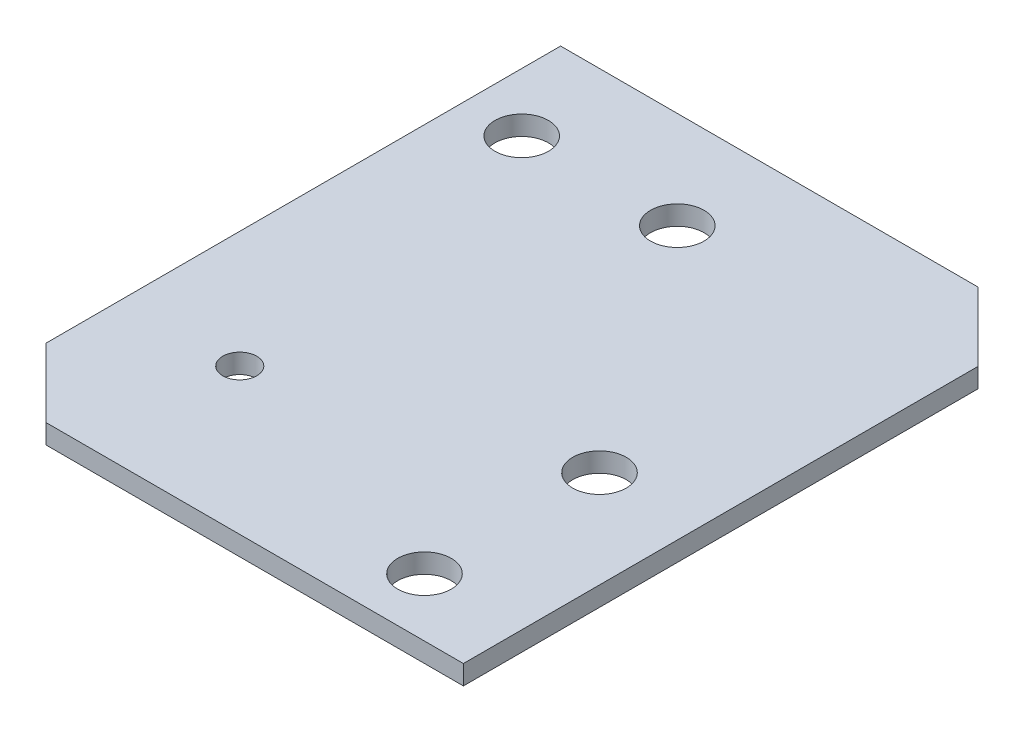
ISO-10303-21;
HEADER;
FILE_DESCRIPTION(('STEP AP214'),'2;1');
FILE_NAME('part.step','',(''),(''),'','','');
FILE_SCHEMA(('AUTOMOTIVE_DESIGN { 1 0 10303 214 1 1 1 1 }'));
ENDSEC;
DATA;
#1=APPLICATION_CONTEXT('core data for automotive mechanical design processes');
#2=APPLICATION_PROTOCOL_DEFINITION('international standard','automotive_design',2000,#1);
#3=PRODUCT_CONTEXT('',#1,'mechanical');
#4=PRODUCT('Part','Part','',(#3));
#5=PRODUCT_RELATED_PRODUCT_CATEGORY('part','',(#4));
#6=PRODUCT_DEFINITION_FORMATION('','',#4);
#7=PRODUCT_DEFINITION_CONTEXT('part definition',#1,'design');
#8=PRODUCT_DEFINITION('design','',#6,#7);
#9=PRODUCT_DEFINITION_SHAPE('','',#8);
#10=(LENGTH_UNIT() NAMED_UNIT(*) SI_UNIT(.MILLI.,.METRE.));
#11=(NAMED_UNIT(*) PLANE_ANGLE_UNIT() SI_UNIT($,.RADIAN.));
#12=(NAMED_UNIT(*) SI_UNIT($,.STERADIAN.) SOLID_ANGLE_UNIT());
#13=UNCERTAINTY_MEASURE_WITH_UNIT(LENGTH_MEASURE(1.E-05),#10,'distance_accuracy_value','');
#14=(GEOMETRIC_REPRESENTATION_CONTEXT(3) GLOBAL_UNCERTAINTY_ASSIGNED_CONTEXT((#13)) GLOBAL_UNIT_ASSIGNED_CONTEXT((#10,
#11,#12)) REPRESENTATION_CONTEXT('',''));
#15=CARTESIAN_POINT('',(0.,0.,0.));
#16=DIRECTION('',(0.,0.,1.));
#17=DIRECTION('',(1.,0.,0.));
#18=AXIS2_PLACEMENT_3D('',#15,#16,#17);
#19=CARTESIAN_POINT('',(0.,2.,-60.));
#20=DIRECTION('',(1.,0.,0.));
#21=DIRECTION('',(0.,0.,-1.));
#22=AXIS2_PLACEMENT_3D('',#19,#20,#21);
#23=PLANE('',#22);
#24=DIRECTION('',(0.,0.,1.));
#25=VECTOR('',#24,1.);
#26=CARTESIAN_POINT('',(0.,0.,-60.));
#27=LINE('',#26,#25);
#28=CARTESIAN_POINT('',(0.,0.,-60.));
#29=VERTEX_POINT('',#28);
#30=CARTESIAN_POINT('',(0.,0.,-7.07106781186549));
#31=VERTEX_POINT('',#30);
#32=EDGE_CURVE('E115',#29,#31,#27,.T.);
#33=ORIENTED_EDGE('',*,*,#32,.T.);
#34=DIRECTION('',(0.,1.,0.));
#35=VECTOR('',#34,1.);
#36=CARTESIAN_POINT('',(0.,0.,-7.07106781186549));
#37=LINE('',#36,#35);
#38=CARTESIAN_POINT('',(0.,2.,-7.07106781186549));
#39=VERTEX_POINT('',#38);
#40=EDGE_CURVE('E62',#31,#39,#37,.T.);
#41=ORIENTED_EDGE('',*,*,#40,.T.);
#42=DIRECTION('',(0.,0.,1.));
#43=VECTOR('',#42,1.);
#44=CARTESIAN_POINT('',(0.,2.,-60.));
#45=LINE('',#44,#43);
#46=CARTESIAN_POINT('',(0.,2.,-60.));
#47=VERTEX_POINT('',#46);
#48=EDGE_CURVE('E126',#47,#39,#45,.T.);
#49=ORIENTED_EDGE('',*,*,#48,.F.);
#50=DIRECTION('',(0.,-1.,0.));
#51=VECTOR('',#50,1.);
#52=CARTESIAN_POINT('',(0.,2.,-60.));
#53=LINE('',#52,#51);
#54=EDGE_CURVE('E47',#47,#29,#53,.T.);
#55=ORIENTED_EDGE('',*,*,#54,.T.);
#56=EDGE_LOOP('',(#33,#41,#49,#55));
#57=FACE_BOUND('',#56,.T.);
#58=ADVANCED_FACE('F39',(#57),#23,.F.);
#59=CARTESIAN_POINT('',(0.,2.,0.));
#60=DIRECTION('',(0.,0.,-1.));
#61=DIRECTION('',(-1.,0.,0.));
#62=AXIS2_PLACEMENT_3D('',#59,#60,#61);
#63=PLANE('',#62);
#64=DIRECTION('',(1.,0.,0.));
#65=VECTOR('',#64,1.);
#66=CARTESIAN_POINT('',(0.,2.,0.));
#67=LINE('',#66,#65);
#68=CARTESIAN_POINT('',(7.07106781186546,2.,0.));
#69=VERTEX_POINT('',#68);
#70=CARTESIAN_POINT('',(50.,2.,0.));
#71=VERTEX_POINT('',#70);
#72=EDGE_CURVE('E106',#69,#71,#67,.T.);
#73=ORIENTED_EDGE('',*,*,#72,.F.);
#74=DIRECTION('',(0.,1.,0.));
#75=VECTOR('',#74,1.);
#76=CARTESIAN_POINT('',(7.07106781186546,0.,0.));
#77=LINE('',#76,#75);
#78=CARTESIAN_POINT('',(7.07106781186546,0.,0.));
#79=VERTEX_POINT('',#78);
#80=EDGE_CURVE('E92',#79,#69,#77,.T.);
#81=ORIENTED_EDGE('',*,*,#80,.F.);
#82=DIRECTION('',(1.,0.,0.));
#83=VECTOR('',#82,1.);
#84=CARTESIAN_POINT('',(0.,0.,0.));
#85=LINE('',#84,#83);
#86=CARTESIAN_POINT('',(50.,0.,0.));
#87=VERTEX_POINT('',#86);
#88=EDGE_CURVE('E105',#79,#87,#85,.T.);
#89=ORIENTED_EDGE('',*,*,#88,.T.);
#90=DIRECTION('',(0.,-1.,0.));
#91=VECTOR('',#90,1.);
#92=CARTESIAN_POINT('',(50.,2.,0.));
#93=LINE('',#92,#91);
#94=EDGE_CURVE('E11',#71,#87,#93,.T.);
#95=ORIENTED_EDGE('',*,*,#94,.F.);
#96=EDGE_LOOP('',(#73,#81,#89,#95));
#97=FACE_BOUND('',#96,.T.);
#98=ADVANCED_FACE('F103',(#97),#63,.F.);
#99=CARTESIAN_POINT('',(50.,2.,0.));
#100=DIRECTION('',(-1.,0.,0.));
#101=DIRECTION('',(0.,0.,1.));
#102=AXIS2_PLACEMENT_3D('',#99,#100,#101);
#103=PLANE('',#102);
#104=DIRECTION('',(0.,0.,-1.));
#105=VECTOR('',#104,1.);
#106=CARTESIAN_POINT('',(50.,0.,0.));
#107=LINE('',#106,#105);
#108=CARTESIAN_POINT('',(50.,0.,-52.9289321881345));
#109=VERTEX_POINT('',#108);
#110=EDGE_CURVE('E113',#87,#109,#107,.T.);
#111=ORIENTED_EDGE('',*,*,#110,.T.);
#112=DIRECTION('',(0.,1.,0.));
#113=VECTOR('',#112,1.);
#114=CARTESIAN_POINT('',(50.,0.,-52.9289321881345));
#115=LINE('',#114,#113);
#116=CARTESIAN_POINT('',(50.,2.,-52.9289321881345));
#117=VERTEX_POINT('',#116);
#118=EDGE_CURVE('E54',#109,#117,#115,.T.);
#119=ORIENTED_EDGE('',*,*,#118,.T.);
#120=DIRECTION('',(0.,0.,-1.));
#121=VECTOR('',#120,1.);
#122=CARTESIAN_POINT('',(50.,2.,0.));
#123=LINE('',#122,#121);
#124=EDGE_CURVE('E134',#71,#117,#123,.T.);
#125=ORIENTED_EDGE('',*,*,#124,.F.);
#126=ORIENTED_EDGE('',*,*,#94,.T.);
#127=EDGE_LOOP('',(#111,#119,#125,#126));
#128=FACE_BOUND('',#127,.T.);
#129=ADVANCED_FACE('F236',(#128),#103,.F.);
#130=CARTESIAN_POINT('',(50.,2.,-60.));
#131=DIRECTION('',(0.,0.,1.));
#132=DIRECTION('',(1.,0.,0.));
#133=AXIS2_PLACEMENT_3D('',#130,#131,#132);
#134=PLANE('',#133);
#135=DIRECTION('',(-1.,0.,0.));
#136=VECTOR('',#135,1.);
#137=CARTESIAN_POINT('',(50.,2.,-60.));
#138=LINE('',#137,#136);
#139=CARTESIAN_POINT('',(42.9289321881346,2.,-60.));
#140=VERTEX_POINT('',#139);
#141=EDGE_CURVE('E129',#140,#47,#138,.T.);
#142=ORIENTED_EDGE('',*,*,#141,.F.);
#143=DIRECTION('',(0.,1.,0.));
#144=VECTOR('',#143,1.);
#145=CARTESIAN_POINT('',(42.9289321881346,0.,-60.));
#146=LINE('',#145,#144);
#147=CARTESIAN_POINT('',(42.9289321881346,0.,-60.));
#148=VERTEX_POINT('',#147);
#149=EDGE_CURVE('E165',#148,#140,#146,.T.);
#150=ORIENTED_EDGE('',*,*,#149,.F.);
#151=DIRECTION('',(-1.,0.,0.));
#152=VECTOR('',#151,1.);
#153=CARTESIAN_POINT('',(50.,0.,-60.));
#154=LINE('',#153,#152);
#155=EDGE_CURVE('E119',#148,#29,#154,.T.);
#156=ORIENTED_EDGE('',*,*,#155,.T.);
#157=ORIENTED_EDGE('',*,*,#54,.F.);
#158=EDGE_LOOP('',(#142,#150,#156,#157));
#159=FACE_BOUND('',#158,.T.);
#160=ADVANCED_FACE('F214',(#159),#134,.F.);
#161=CARTESIAN_POINT('',(0.,2.,0.));
#162=DIRECTION('',(0.,1.,0.));
#163=DIRECTION('',(0.,0.,1.));
#164=AXIS2_PLACEMENT_3D('',#161,#162,#163);
#165=PLANE('',#164);
#166=CARTESIAN_POINT('',(40.,2.,-6.));
#167=DIRECTION('',(0.,1.,0.));
#168=DIRECTION('',(0.,0.,1.));
#169=AXIS2_PLACEMENT_3D('',#166,#167,#168);
#170=CIRCLE('',#169,2.75000000000001);
#171=CARTESIAN_POINT('',(40.,2.,-3.24999999999999));
#172=VERTEX_POINT('',#171);
#173=EDGE_CURVE('E183',#172,#172,#170,.T.);
#174=ORIENTED_EDGE('',*,*,#173,.F.);
#175=EDGE_LOOP('',(#174));
#176=FACE_BOUND('',#175,.T.);
#177=CARTESIAN_POINT('',(12.,2.,-15.));
#178=DIRECTION('',(0.,1.,0.));
#179=DIRECTION('',(0.,0.,1.));
#180=AXIS2_PLACEMENT_3D('',#177,#178,#179);
#181=CIRCLE('',#180,1.75);
#182=CARTESIAN_POINT('',(12.,2.,-13.25));
#183=VERTEX_POINT('',#182);
#184=EDGE_CURVE('E171',#183,#183,#181,.T.);
#185=ORIENTED_EDGE('',*,*,#184,.F.);
#186=EDGE_LOOP('',(#185));
#187=FACE_BOUND('',#186,.T.);
#188=DIRECTION('',(0.707106781186544,0.,0.707106781186551));
#189=VECTOR('',#188,1.);
#190=CARTESIAN_POINT('',(50.,2.,-52.9289321881345));
#191=LINE('',#190,#189);
#192=EDGE_CURVE('E164',#140,#117,#191,.T.);
#193=ORIENTED_EDGE('',*,*,#192,.F.);
#194=ORIENTED_EDGE('',*,*,#141,.T.);
#195=ORIENTED_EDGE('',*,*,#48,.T.);
#196=DIRECTION('',(-0.707106781186546,0.,-0.707106781186549));
#197=VECTOR('',#196,1.);
#198=CARTESIAN_POINT('',(0.,2.,-7.07106781186549));
#199=LINE('',#198,#197);
#200=EDGE_CURVE('E99',#69,#39,#199,.T.);
#201=ORIENTED_EDGE('',*,*,#200,.F.);
#202=ORIENTED_EDGE('',*,*,#72,.T.);
#203=ORIENTED_EDGE('',*,*,#124,.T.);
#204=EDGE_LOOP('',(#193,#194,#195,#201,#202,#203));
#205=FACE_BOUND('',#204,.T.);
#206=CARTESIAN_POINT('',(39.9999999999999,2.,-24.));
#207=DIRECTION('',(0.,1.,0.));
#208=DIRECTION('',(0.,0.,1.));
#209=AXIS2_PLACEMENT_3D('',#206,#207,#208);
#210=CIRCLE('',#209,2.75000000000001);
#211=CARTESIAN_POINT('',(39.9999999999999,2.,-21.25));
#212=VERTEX_POINT('',#211);
#213=EDGE_CURVE('E155',#212,#212,#210,.T.);
#214=ORIENTED_EDGE('',*,*,#213,.F.);
#215=EDGE_LOOP('',(#214));
#216=FACE_BOUND('',#215,.T.);
#217=CARTESIAN_POINT('',(22.,2.,-50.));
#218=DIRECTION('',(0.,1.,0.));
#219=DIRECTION('',(0.,0.,1.));
#220=AXIS2_PLACEMENT_3D('',#217,#218,#219);
#221=CIRCLE('',#220,2.75000000000001);
#222=CARTESIAN_POINT('',(22.,2.,-47.25));
#223=VERTEX_POINT('',#222);
#224=EDGE_CURVE('E192',#223,#223,#221,.T.);
#225=ORIENTED_EDGE('',*,*,#224,.F.);
#226=EDGE_LOOP('',(#225));
#227=FACE_BOUND('',#226,.T.);
#228=CARTESIAN_POINT('',(6.,2.,-50.));
#229=DIRECTION('',(0.,1.,0.));
#230=DIRECTION('',(0.,0.,1.));
#231=AXIS2_PLACEMENT_3D('',#228,#229,#230);
#232=CIRCLE('',#231,2.75000000000001);
#233=CARTESIAN_POINT('',(6.,2.,-47.25));
#234=VERTEX_POINT('',#233);
#235=EDGE_CURVE('E147',#234,#234,#232,.T.);
#236=ORIENTED_EDGE('',*,*,#235,.F.);
#237=EDGE_LOOP('',(#236));
#238=FACE_BOUND('',#237,.T.);
#239=ADVANCED_FACE('F211',(#176,#187,#205,#216,#227,#238),#165,.T.);
#240=CARTESIAN_POINT('',(0.,0.,0.));
#241=DIRECTION('',(0.,1.,0.));
#242=DIRECTION('',(0.,0.,1.));
#243=AXIS2_PLACEMENT_3D('',#240,#241,#242);
#244=PLANE('',#243);
#245=CARTESIAN_POINT('',(40.,0.,-6.));
#246=DIRECTION('',(0.,1.,0.));
#247=DIRECTION('',(0.,0.,1.));
#248=AXIS2_PLACEMENT_3D('',#245,#246,#247);
#249=CIRCLE('',#248,2.75000000000001);
#250=CARTESIAN_POINT('',(40.,0.,-3.24999999999999));
#251=VERTEX_POINT('',#250);
#252=EDGE_CURVE('E151',#251,#251,#249,.T.);
#253=ORIENTED_EDGE('',*,*,#252,.T.);
#254=EDGE_LOOP('',(#253));
#255=FACE_BOUND('',#254,.T.);
#256=CARTESIAN_POINT('',(12.,0.,-15.));
#257=DIRECTION('',(0.,1.,0.));
#258=DIRECTION('',(0.,0.,1.));
#259=AXIS2_PLACEMENT_3D('',#256,#257,#258);
#260=CIRCLE('',#259,1.75);
#261=CARTESIAN_POINT('',(12.,0.,-13.25));
#262=VERTEX_POINT('',#261);
#263=EDGE_CURVE('E179',#262,#262,#260,.T.);
#264=ORIENTED_EDGE('',*,*,#263,.T.);
#265=EDGE_LOOP('',(#264));
#266=FACE_BOUND('',#265,.T.);
#267=CARTESIAN_POINT('',(39.9999999999999,0.,-24.));
#268=DIRECTION('',(0.,1.,0.));
#269=DIRECTION('',(0.,0.,1.));
#270=AXIS2_PLACEMENT_3D('',#267,#268,#269);
#271=CIRCLE('',#270,2.75000000000001);
#272=CARTESIAN_POINT('',(39.9999999999999,0.,-21.25));
#273=VERTEX_POINT('',#272);
#274=EDGE_CURVE('E159',#273,#273,#271,.T.);
#275=ORIENTED_EDGE('',*,*,#274,.T.);
#276=EDGE_LOOP('',(#275));
#277=FACE_BOUND('',#276,.T.);
#278=CARTESIAN_POINT('',(22.,0.,-50.));
#279=DIRECTION('',(0.,1.,0.));
#280=DIRECTION('',(0.,0.,1.));
#281=AXIS2_PLACEMENT_3D('',#278,#279,#280);
#282=CIRCLE('',#281,2.75000000000001);
#283=CARTESIAN_POINT('',(22.,0.,-47.25));
#284=VERTEX_POINT('',#283);
#285=EDGE_CURVE('E160',#284,#284,#282,.T.);
#286=ORIENTED_EDGE('',*,*,#285,.T.);
#287=EDGE_LOOP('',(#286));
#288=FACE_BOUND('',#287,.T.);
#289=CARTESIAN_POINT('',(6.,0.,-50.));
#290=DIRECTION('',(0.,1.,0.));
#291=DIRECTION('',(0.,0.,1.));
#292=AXIS2_PLACEMENT_3D('',#289,#290,#291);
#293=CIRCLE('',#292,2.75000000000001);
#294=CARTESIAN_POINT('',(6.,0.,-47.25));
#295=VERTEX_POINT('',#294);
#296=EDGE_CURVE('E121',#295,#295,#293,.T.);
#297=ORIENTED_EDGE('',*,*,#296,.T.);
#298=EDGE_LOOP('',(#297));
#299=FACE_BOUND('',#298,.T.);
#300=ORIENTED_EDGE('',*,*,#155,.F.);
#301=DIRECTION('',(0.707106781186544,0.,0.707106781186551));
#302=VECTOR('',#301,1.);
#303=CARTESIAN_POINT('',(50.,0.,-52.9289321881345));
#304=LINE('',#303,#302);
#305=EDGE_CURVE('E168',#148,#109,#304,.T.);
#306=ORIENTED_EDGE('',*,*,#305,.T.);
#307=ORIENTED_EDGE('',*,*,#110,.F.);
#308=ORIENTED_EDGE('',*,*,#88,.F.);
#309=DIRECTION('',(-0.707106781186546,0.,-0.707106781186549));
#310=VECTOR('',#309,1.);
#311=CARTESIAN_POINT('',(0.,0.,-7.07106781186549));
#312=LINE('',#311,#310);
#313=EDGE_CURVE('E89',#79,#31,#312,.T.);
#314=ORIENTED_EDGE('',*,*,#313,.T.);
#315=ORIENTED_EDGE('',*,*,#32,.F.);
#316=EDGE_LOOP('',(#300,#306,#307,#308,#314,#315));
#317=FACE_BOUND('',#316,.T.);
#318=ADVANCED_FACE('F111',(#255,#266,#277,#288,#299,#317),#244,.F.);
#319=CARTESIAN_POINT('',(6.,0.,-50.));
#320=DIRECTION('',(0.,1.,0.));
#321=DIRECTION('',(0.,0.,1.));
#322=AXIS2_PLACEMENT_3D('',#319,#320,#321);
#323=CYLINDRICAL_SURFACE('',#322,2.75000000000001);
#324=ORIENTED_EDGE('',*,*,#296,.F.);
#325=EDGE_LOOP('',(#324));
#326=FACE_BOUND('',#325,.T.);
#327=ORIENTED_EDGE('',*,*,#235,.T.);
#328=EDGE_LOOP('',(#327));
#329=FACE_BOUND('',#328,.T.);
#330=ADVANCED_FACE('F219',(#326,#329),#323,.F.);
#331=CARTESIAN_POINT('',(0.,0.,-7.07106781186549));
#332=DIRECTION('',(0.707106781186549,0.,-0.707106781186546));
#333=DIRECTION('',(-0.707106781186546,0.,-0.707106781186549));
#334=AXIS2_PLACEMENT_3D('',#331,#332,#333);
#335=PLANE('',#334);
#336=ORIENTED_EDGE('',*,*,#200,.T.);
#337=ORIENTED_EDGE('',*,*,#40,.F.);
#338=ORIENTED_EDGE('',*,*,#313,.F.);
#339=ORIENTED_EDGE('',*,*,#80,.T.);
#340=EDGE_LOOP('',(#336,#337,#338,#339));
#341=FACE_BOUND('',#340,.T.);
#342=ADVANCED_FACE('F91',(#341),#335,.F.);
#343=CARTESIAN_POINT('',(22.,0.,-50.));
#344=DIRECTION('',(0.,1.,0.));
#345=DIRECTION('',(0.,0.,1.));
#346=AXIS2_PLACEMENT_3D('',#343,#344,#345);
#347=CYLINDRICAL_SURFACE('',#346,2.75000000000001);
#348=ORIENTED_EDGE('',*,*,#285,.F.);
#349=EDGE_LOOP('',(#348));
#350=FACE_BOUND('',#349,.T.);
#351=ORIENTED_EDGE('',*,*,#224,.T.);
#352=EDGE_LOOP('',(#351));
#353=FACE_BOUND('',#352,.T.);
#354=ADVANCED_FACE('F204',(#350,#353),#347,.F.);
#355=CARTESIAN_POINT('',(39.9999999999999,0.,-24.));
#356=DIRECTION('',(0.,1.,0.));
#357=DIRECTION('',(0.,0.,1.));
#358=AXIS2_PLACEMENT_3D('',#355,#356,#357);
#359=CYLINDRICAL_SURFACE('',#358,2.75000000000001);
#360=ORIENTED_EDGE('',*,*,#274,.F.);
#361=EDGE_LOOP('',(#360));
#362=FACE_BOUND('',#361,.T.);
#363=ORIENTED_EDGE('',*,*,#213,.T.);
#364=EDGE_LOOP('',(#363));
#365=FACE_BOUND('',#364,.T.);
#366=ADVANCED_FACE('F207',(#362,#365),#359,.F.);
#367=CARTESIAN_POINT('',(50.,0.,-52.9289321881345));
#368=DIRECTION('',(-0.707106781186551,0.,0.707106781186544));
#369=DIRECTION('',(0.707106781186544,0.,0.707106781186551));
#370=AXIS2_PLACEMENT_3D('',#367,#368,#369);
#371=PLANE('',#370);
#372=ORIENTED_EDGE('',*,*,#192,.T.);
#373=ORIENTED_EDGE('',*,*,#118,.F.);
#374=ORIENTED_EDGE('',*,*,#305,.F.);
#375=ORIENTED_EDGE('',*,*,#149,.T.);
#376=EDGE_LOOP('',(#372,#373,#374,#375));
#377=FACE_BOUND('',#376,.T.);
#378=ADVANCED_FACE('F239',(#377),#371,.F.);
#379=CARTESIAN_POINT('',(12.,0.,-15.));
#380=DIRECTION('',(0.,1.,0.));
#381=DIRECTION('',(0.,0.,1.));
#382=AXIS2_PLACEMENT_3D('',#379,#380,#381);
#383=CYLINDRICAL_SURFACE('',#382,1.75);
#384=ORIENTED_EDGE('',*,*,#263,.F.);
#385=EDGE_LOOP('',(#384));
#386=FACE_BOUND('',#385,.T.);
#387=ORIENTED_EDGE('',*,*,#184,.T.);
#388=EDGE_LOOP('',(#387));
#389=FACE_BOUND('',#388,.T.);
#390=ADVANCED_FACE('F292',(#386,#389),#383,.F.);
#391=CARTESIAN_POINT('',(40.,0.,-6.));
#392=DIRECTION('',(0.,1.,0.));
#393=DIRECTION('',(0.,0.,1.));
#394=AXIS2_PLACEMENT_3D('',#391,#392,#393);
#395=CYLINDRICAL_SURFACE('',#394,2.75000000000001);
#396=ORIENTED_EDGE('',*,*,#252,.F.);
#397=EDGE_LOOP('',(#396));
#398=FACE_BOUND('',#397,.T.);
#399=ORIENTED_EDGE('',*,*,#173,.T.);
#400=EDGE_LOOP('',(#399));
#401=FACE_BOUND('',#400,.T.);
#402=ADVANCED_FACE('F301',(#398,#401),#395,.F.);
#403=CLOSED_SHELL('',(#58,#98,#129,#160,#239,#318,#330,#342,#354,#366,#378,#390,#402));
#404=MANIFOLD_SOLID_BREP('B2',#403);
#405=ADVANCED_BREP_SHAPE_REPRESENTATION('',(#18,#404),#14);
#406=SHAPE_DEFINITION_REPRESENTATION(#9,#405);
ENDSEC;
END-ISO-10303-21;
